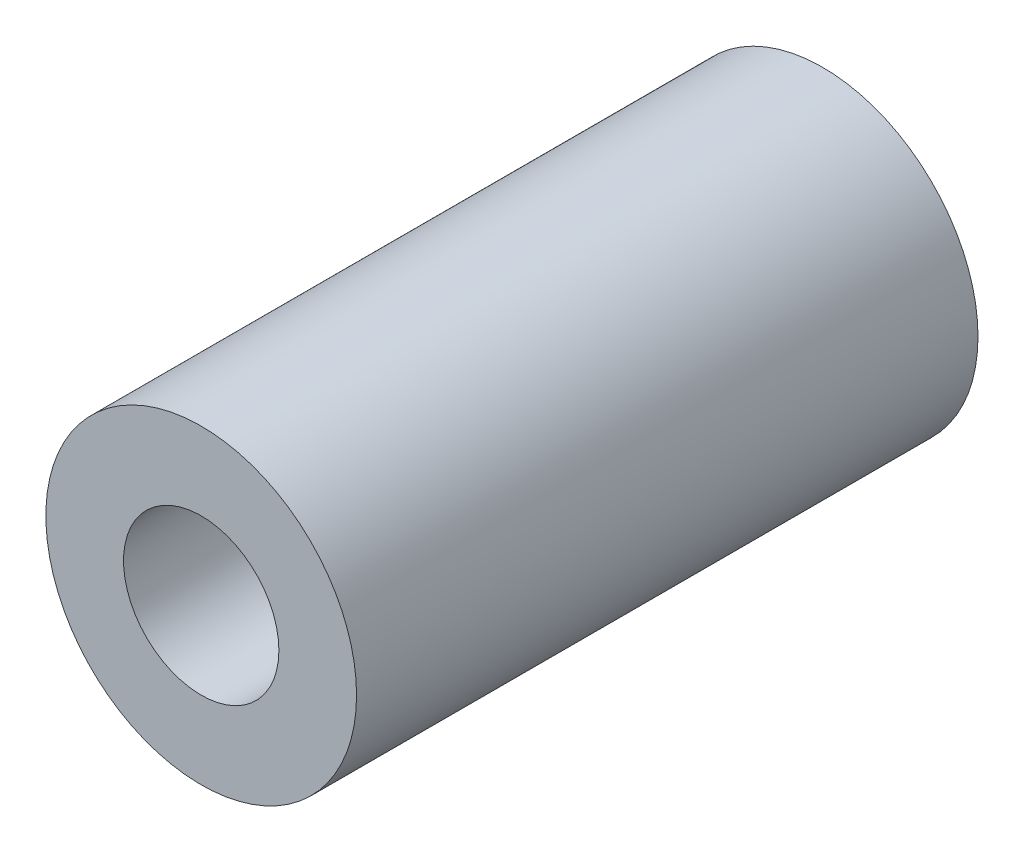
ISO-10303-21;
HEADER;
FILE_DESCRIPTION(('STEP AP214'),'2;1');
FILE_NAME('part.step','',(''),(''),'','','');
FILE_SCHEMA(('AUTOMOTIVE_DESIGN { 1 0 10303 214 1 1 1 1 }'));
ENDSEC;
DATA;
#1=APPLICATION_CONTEXT('core data for automotive mechanical design processes');
#2=APPLICATION_PROTOCOL_DEFINITION('international standard','automotive_design',2000,#1);
#3=PRODUCT_CONTEXT('',#1,'mechanical');
#4=PRODUCT('Part','Part','',(#3));
#5=PRODUCT_RELATED_PRODUCT_CATEGORY('part','',(#4));
#6=PRODUCT_DEFINITION_FORMATION('','',#4);
#7=PRODUCT_DEFINITION_CONTEXT('part definition',#1,'design');
#8=PRODUCT_DEFINITION('design','',#6,#7);
#9=PRODUCT_DEFINITION_SHAPE('','',#8);
#10=(LENGTH_UNIT() NAMED_UNIT(*) SI_UNIT(.MILLI.,.METRE.));
#11=(NAMED_UNIT(*) PLANE_ANGLE_UNIT() SI_UNIT($,.RADIAN.));
#12=(NAMED_UNIT(*) SI_UNIT($,.STERADIAN.) SOLID_ANGLE_UNIT());
#13=UNCERTAINTY_MEASURE_WITH_UNIT(LENGTH_MEASURE(1.E-05),#10,'distance_accuracy_value','');
#14=(GEOMETRIC_REPRESENTATION_CONTEXT(3) GLOBAL_UNCERTAINTY_ASSIGNED_CONTEXT((#13)) GLOBAL_UNIT_ASSIGNED_CONTEXT((#10,
#11,#12)) REPRESENTATION_CONTEXT('',''));
#15=CARTESIAN_POINT('',(0.,0.,0.));
#16=DIRECTION('',(0.,0.,1.));
#17=DIRECTION('',(1.,0.,0.));
#18=AXIS2_PLACEMENT_3D('',#15,#16,#17);
#19=CARTESIAN_POINT('',(0.,0.,12.));
#20=DIRECTION('',(0.,0.,1.));
#21=DIRECTION('',(1.,0.,0.));
#22=AXIS2_PLACEMENT_3D('',#19,#20,#21);
#23=PLANE('',#22);
#24=CARTESIAN_POINT('',(0.,0.,12.));
#25=DIRECTION('',(0.,0.,1.));
#26=DIRECTION('',(1.,0.,0.));
#27=AXIS2_PLACEMENT_3D('',#24,#25,#26);
#28=CIRCLE('',#27,3.);
#29=CARTESIAN_POINT('',(3.,0.,12.));
#30=VERTEX_POINT('',#29);
#31=EDGE_CURVE('E10',#30,#30,#28,.T.);
#32=ORIENTED_EDGE('',*,*,#31,.T.);
#33=EDGE_LOOP('',(#32));
#34=FACE_BOUND('',#33,.T.);
#35=CARTESIAN_POINT('',(0.,0.,12.));
#36=DIRECTION('',(0.,0.,1.));
#37=DIRECTION('',(1.,0.,0.));
#38=AXIS2_PLACEMENT_3D('',#35,#36,#37);
#39=CIRCLE('',#38,1.5);
#40=CARTESIAN_POINT('',(1.5,0.,12.));
#41=VERTEX_POINT('',#40);
#42=EDGE_CURVE('E48',#41,#41,#39,.T.);
#43=ORIENTED_EDGE('',*,*,#42,.F.);
#44=EDGE_LOOP('',(#43));
#45=FACE_BOUND('',#44,.T.);
#46=ADVANCED_FACE('F37',(#34,#45),#23,.T.);
#47=CARTESIAN_POINT('',(0.,0.,0.));
#48=DIRECTION('',(0.,0.,1.));
#49=DIRECTION('',(1.,0.,0.));
#50=AXIS2_PLACEMENT_3D('',#47,#48,#49);
#51=PLANE('',#50);
#52=CARTESIAN_POINT('',(0.,0.,0.));
#53=DIRECTION('',(0.,0.,1.));
#54=DIRECTION('',(1.,0.,0.));
#55=AXIS2_PLACEMENT_3D('',#52,#53,#54);
#56=CIRCLE('',#55,3.);
#57=CARTESIAN_POINT('',(3.,0.,0.));
#58=VERTEX_POINT('',#57);
#59=EDGE_CURVE('E41',#58,#58,#56,.T.);
#60=ORIENTED_EDGE('',*,*,#59,.F.);
#61=EDGE_LOOP('',(#60));
#62=FACE_BOUND('',#61,.T.);
#63=CARTESIAN_POINT('',(0.,0.,0.));
#64=DIRECTION('',(0.,0.,1.));
#65=DIRECTION('',(1.,0.,0.));
#66=AXIS2_PLACEMENT_3D('',#63,#64,#65);
#67=CIRCLE('',#66,1.5);
#68=CARTESIAN_POINT('',(1.5,0.,0.));
#69=VERTEX_POINT('',#68);
#70=EDGE_CURVE('E50',#69,#69,#67,.T.);
#71=ORIENTED_EDGE('',*,*,#70,.T.);
#72=EDGE_LOOP('',(#71));
#73=FACE_BOUND('',#72,.T.);
#74=ADVANCED_FACE('F60',(#62,#73),#51,.F.);
#75=CARTESIAN_POINT('',(0.,0.,12.));
#76=DIRECTION('',(0.,0.,-1.));
#77=DIRECTION('',(-1.,0.,0.));
#78=AXIS2_PLACEMENT_3D('',#75,#76,#77);
#79=CYLINDRICAL_SURFACE('',#78,3.);
#80=ORIENTED_EDGE('',*,*,#31,.F.);
#81=EDGE_LOOP('',(#80));
#82=FACE_BOUND('',#81,.T.);
#83=ORIENTED_EDGE('',*,*,#59,.T.);
#84=EDGE_LOOP('',(#83));
#85=FACE_BOUND('',#84,.T.);
#86=ADVANCED_FACE('F39',(#82,#85),#79,.T.);
#87=CARTESIAN_POINT('',(0.,0.,12.));
#88=DIRECTION('',(0.,0.,-1.));
#89=DIRECTION('',(-1.,0.,0.));
#90=AXIS2_PLACEMENT_3D('',#87,#88,#89);
#91=CYLINDRICAL_SURFACE('',#90,1.5);
#92=ORIENTED_EDGE('',*,*,#42,.T.);
#93=EDGE_LOOP('',(#92));
#94=FACE_BOUND('',#93,.T.);
#95=ORIENTED_EDGE('',*,*,#70,.F.);
#96=EDGE_LOOP('',(#95));
#97=FACE_BOUND('',#96,.T.);
#98=ADVANCED_FACE('F56',(#94,#97),#91,.F.);
#99=CLOSED_SHELL('',(#46,#74,#86,#98));
#100=MANIFOLD_SOLID_BREP('B2',#99);
#101=ADVANCED_BREP_SHAPE_REPRESENTATION('',(#18,#100),#14);
#102=SHAPE_DEFINITION_REPRESENTATION(#9,#101);
ENDSEC;
END-ISO-10303-21;
